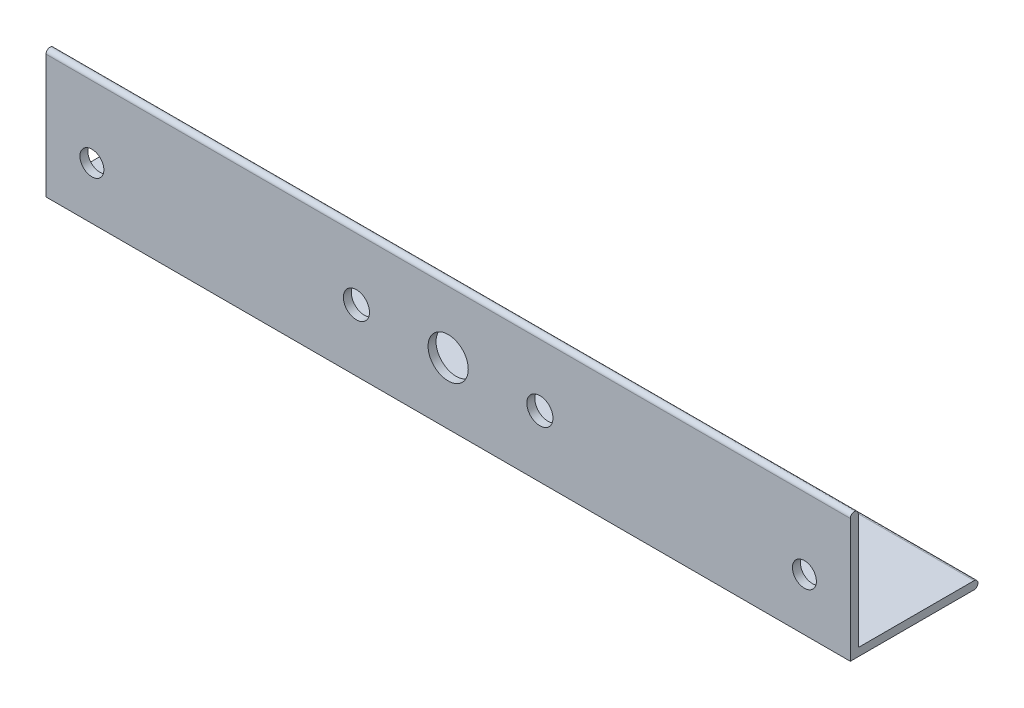
ISO-10303-21;
HEADER;
FILE_DESCRIPTION(('STEP AP214'),'2;1');
FILE_NAME('part.step','',(''),(''),'','','');
FILE_SCHEMA(('AUTOMOTIVE_DESIGN { 1 0 10303 214 1 1 1 1 }'));
ENDSEC;
DATA;
#1=APPLICATION_CONTEXT('core data for automotive mechanical design processes');
#2=APPLICATION_PROTOCOL_DEFINITION('international standard','automotive_design',2000,#1);
#3=PRODUCT_CONTEXT('',#1,'mechanical');
#4=PRODUCT('Part','Part','',(#3));
#5=PRODUCT_RELATED_PRODUCT_CATEGORY('part','',(#4));
#6=PRODUCT_DEFINITION_FORMATION('','',#4);
#7=PRODUCT_DEFINITION_CONTEXT('part definition',#1,'design');
#8=PRODUCT_DEFINITION('design','',#6,#7);
#9=PRODUCT_DEFINITION_SHAPE('','',#8);
#10=(LENGTH_UNIT() NAMED_UNIT(*) SI_UNIT(.MILLI.,.METRE.));
#11=(NAMED_UNIT(*) PLANE_ANGLE_UNIT() SI_UNIT($,.RADIAN.));
#12=(NAMED_UNIT(*) SI_UNIT($,.STERADIAN.) SOLID_ANGLE_UNIT());
#13=UNCERTAINTY_MEASURE_WITH_UNIT(LENGTH_MEASURE(1.E-05),#10,'distance_accuracy_value','');
#14=(GEOMETRIC_REPRESENTATION_CONTEXT(3) GLOBAL_UNCERTAINTY_ASSIGNED_CONTEXT((#13)) GLOBAL_UNIT_ASSIGNED_CONTEXT((#10,
#11,#12)) REPRESENTATION_CONTEXT('',''));
#15=CARTESIAN_POINT('',(0.,0.,0.));
#16=DIRECTION('',(0.,0.,1.));
#17=DIRECTION('',(1.,0.,0.));
#18=AXIS2_PLACEMENT_3D('',#15,#16,#17);
#19=CARTESIAN_POINT('',(160.,0.793749999999999,-24.60625));
#20=DIRECTION('',(-1.,0.,0.));
#21=DIRECTION('',(0.,0.,1.));
#22=AXIS2_PLACEMENT_3D('',#19,#20,#21);
#23=CYLINDRICAL_SURFACE('',#22,0.793749999999999);
#24=DIRECTION('',(-1.,0.,0.));
#25=VECTOR('',#24,1.);
#26=CARTESIAN_POINT('',(160.,1.5875,-24.60625));
#27=LINE('',#26,#25);
#28=CARTESIAN_POINT('',(160.,1.5875,-24.60625));
#29=VERTEX_POINT('',#28);
#30=CARTESIAN_POINT('',(0.,1.5875,-24.60625));
#31=VERTEX_POINT('',#30);
#32=EDGE_CURVE('E153',#29,#31,#27,.T.);
#33=ORIENTED_EDGE('',*,*,#32,.F.);
#34=CARTESIAN_POINT('',(160.,0.793749999999999,-24.60625));
#35=DIRECTION('',(-1.,0.,0.));
#36=DIRECTION('',(0.,0.,1.));
#37=AXIS2_PLACEMENT_3D('',#34,#35,#36);
#38=CIRCLE('',#37,0.793749999999999);
#39=CARTESIAN_POINT('',(160.,0.,-24.60625));
#40=VERTEX_POINT('',#39);
#41=EDGE_CURVE('E50',#40,#29,#38,.F.);
#42=ORIENTED_EDGE('',*,*,#41,.F.);
#43=DIRECTION('',(-1.,0.,0.));
#44=VECTOR('',#43,1.);
#45=CARTESIAN_POINT('',(160.,0.,-24.60625));
#46=LINE('',#45,#44);
#47=CARTESIAN_POINT('',(0.,0.,-24.60625));
#48=VERTEX_POINT('',#47);
#49=EDGE_CURVE('E156',#48,#40,#46,.F.);
#50=ORIENTED_EDGE('',*,*,#49,.F.);
#51=CARTESIAN_POINT('',(0.,0.793749999999999,-24.60625));
#52=DIRECTION('',(-1.,0.,0.));
#53=DIRECTION('',(0.,0.,1.));
#54=AXIS2_PLACEMENT_3D('',#51,#52,#53);
#55=CIRCLE('',#54,0.793749999999999);
#56=EDGE_CURVE('E11',#31,#48,#55,.T.);
#57=ORIENTED_EDGE('',*,*,#56,.F.);
#58=EDGE_LOOP('',(#33,#42,#50,#57));
#59=FACE_BOUND('',#58,.T.);
#60=ADVANCED_FACE('F41',(#59),#23,.T.);
#61=CARTESIAN_POINT('',(160.,24.60625,-0.79375));
#62=DIRECTION('',(-1.,0.,0.));
#63=DIRECTION('',(0.,0.,1.));
#64=AXIS2_PLACEMENT_3D('',#61,#62,#63);
#65=CYLINDRICAL_SURFACE('',#64,0.79375);
#66=DIRECTION('',(-1.,0.,0.));
#67=VECTOR('',#66,1.);
#68=CARTESIAN_POINT('',(160.,24.60625,0.));
#69=LINE('',#68,#67);
#70=CARTESIAN_POINT('',(160.,24.60625,0.));
#71=VERTEX_POINT('',#70);
#72=CARTESIAN_POINT('',(0.,24.60625,0.));
#73=VERTEX_POINT('',#72);
#74=EDGE_CURVE('E112',#71,#73,#69,.T.);
#75=ORIENTED_EDGE('',*,*,#74,.F.);
#76=CARTESIAN_POINT('',(160.,24.60625,-0.79375));
#77=DIRECTION('',(-1.,0.,0.));
#78=DIRECTION('',(0.,0.,1.));
#79=AXIS2_PLACEMENT_3D('',#76,#77,#78);
#80=CIRCLE('',#79,0.79375);
#81=CARTESIAN_POINT('',(160.,24.60625,-1.5875));
#82=VERTEX_POINT('',#81);
#83=EDGE_CURVE('E147',#82,#71,#80,.F.);
#84=ORIENTED_EDGE('',*,*,#83,.F.);
#85=DIRECTION('',(-1.,0.,0.));
#86=VECTOR('',#85,1.);
#87=CARTESIAN_POINT('',(160.,24.60625,-1.5875));
#88=LINE('',#87,#86);
#89=CARTESIAN_POINT('',(0.,24.60625,-1.5875));
#90=VERTEX_POINT('',#89);
#91=EDGE_CURVE('E118',#90,#82,#88,.F.);
#92=ORIENTED_EDGE('',*,*,#91,.F.);
#93=CARTESIAN_POINT('',(0.,24.60625,-0.79375));
#94=DIRECTION('',(-1.,0.,0.));
#95=DIRECTION('',(0.,0.,1.));
#96=AXIS2_PLACEMENT_3D('',#93,#94,#95);
#97=CIRCLE('',#96,0.79375);
#98=EDGE_CURVE('E150',#73,#90,#97,.T.);
#99=ORIENTED_EDGE('',*,*,#98,.F.);
#100=EDGE_LOOP('',(#75,#84,#92,#99));
#101=FACE_BOUND('',#100,.T.);
#102=ADVANCED_FACE('F224',(#101),#65,.T.);
#103=CARTESIAN_POINT('',(160.,0.,-25.4));
#104=DIRECTION('',(0.,1.,0.));
#105=DIRECTION('',(0.,0.,1.));
#106=AXIS2_PLACEMENT_3D('',#103,#104,#105);
#107=PLANE('',#106);
#108=DIRECTION('',(0.,0.,-1.));
#109=VECTOR('',#108,1.);
#110=CARTESIAN_POINT('',(0.,0.,-25.4));
#111=LINE('',#110,#109);
#112=CARTESIAN_POINT('',(0.,0.,0.));
#113=VERTEX_POINT('',#112);
#114=EDGE_CURVE('E126',#113,#48,#111,.T.);
#115=ORIENTED_EDGE('',*,*,#114,.T.);
#116=ORIENTED_EDGE('',*,*,#49,.T.);
#117=DIRECTION('',(0.,0.,-1.));
#118=VECTOR('',#117,1.);
#119=CARTESIAN_POINT('',(160.,0.,-25.4));
#120=LINE('',#119,#118);
#121=CARTESIAN_POINT('',(160.,0.,0.));
#122=VERTEX_POINT('',#121);
#123=EDGE_CURVE('E102',#122,#40,#120,.T.);
#124=ORIENTED_EDGE('',*,*,#123,.F.);
#125=DIRECTION('',(-1.,0.,0.));
#126=VECTOR('',#125,1.);
#127=CARTESIAN_POINT('',(160.,0.,0.));
#128=LINE('',#127,#126);
#129=EDGE_CURVE('E113',#122,#113,#128,.T.);
#130=ORIENTED_EDGE('',*,*,#129,.T.);
#131=EDGE_LOOP('',(#115,#116,#124,#130));
#132=FACE_BOUND('',#131,.T.);
#133=ADVANCED_FACE('F161',(#132),#107,.F.);
#134=CARTESIAN_POINT('',(160.,1.5875,-1.5875));
#135=DIRECTION('',(0.,-1.,0.));
#136=DIRECTION('',(0.,0.,-1.));
#137=AXIS2_PLACEMENT_3D('',#134,#135,#136);
#138=PLANE('',#137);
#139=DIRECTION('',(0.,0.,1.));
#140=VECTOR('',#139,1.);
#141=CARTESIAN_POINT('',(160.,1.5875,-1.5875));
#142=LINE('',#141,#140);
#143=CARTESIAN_POINT('',(160.,1.5875,-1.5875));
#144=VERTEX_POINT('',#143);
#145=EDGE_CURVE('E93',#29,#144,#142,.T.);
#146=ORIENTED_EDGE('',*,*,#145,.F.);
#147=ORIENTED_EDGE('',*,*,#32,.T.);
#148=DIRECTION('',(0.,0.,1.));
#149=VECTOR('',#148,1.);
#150=CARTESIAN_POINT('',(0.,1.5875,-1.5875));
#151=LINE('',#150,#149);
#152=CARTESIAN_POINT('',(0.,1.5875,-1.5875));
#153=VERTEX_POINT('',#152);
#154=EDGE_CURVE('E107',#31,#153,#151,.T.);
#155=ORIENTED_EDGE('',*,*,#154,.T.);
#156=DIRECTION('',(-1.,0.,0.));
#157=VECTOR('',#156,1.);
#158=CARTESIAN_POINT('',(160.,1.5875,-1.5875));
#159=LINE('',#158,#157);
#160=EDGE_CURVE('E105',#144,#153,#159,.T.);
#161=ORIENTED_EDGE('',*,*,#160,.F.);
#162=EDGE_LOOP('',(#146,#147,#155,#161));
#163=FACE_BOUND('',#162,.T.);
#164=ADVANCED_FACE('F106',(#163),#138,.F.);
#165=CARTESIAN_POINT('',(160.,25.4,-1.5875));
#166=DIRECTION('',(0.,0.,1.));
#167=DIRECTION('',(0.,-1.,0.));
#168=AXIS2_PLACEMENT_3D('',#165,#166,#167);
#169=PLANE('',#168);
#170=CARTESIAN_POINT('',(61.75,12.303125,-1.5875));
#171=DIRECTION('',(0.,0.,1.));
#172=DIRECTION('',(0.,-1.,0.));
#173=AXIS2_PLACEMENT_3D('',#170,#171,#172);
#174=CIRCLE('',#173,2.59999999999999);
#175=CARTESIAN_POINT('',(61.75,9.70312500000001,-1.5875));
#176=VERTEX_POINT('',#175);
#177=EDGE_CURVE('E178',#176,#176,#174,.T.);
#178=ORIENTED_EDGE('',*,*,#177,.T.);
#179=EDGE_LOOP('',(#178));
#180=FACE_BOUND('',#179,.T.);
#181=CARTESIAN_POINT('',(98.25,12.303125,-1.5875));
#182=DIRECTION('',(0.,0.,1.));
#183=DIRECTION('',(0.,-1.,0.));
#184=AXIS2_PLACEMENT_3D('',#181,#182,#183);
#185=CIRCLE('',#184,2.6);
#186=CARTESIAN_POINT('',(98.25,9.703125,-1.5875));
#187=VERTEX_POINT('',#186);
#188=EDGE_CURVE('E185',#187,#187,#185,.T.);
#189=ORIENTED_EDGE('',*,*,#188,.T.);
#190=EDGE_LOOP('',(#189));
#191=FACE_BOUND('',#190,.T.);
#192=CARTESIAN_POINT('',(80.,12.303125,-1.5875));
#193=DIRECTION('',(0.,0.,1.));
#194=DIRECTION('',(0.,-1.,0.));
#195=AXIS2_PLACEMENT_3D('',#192,#193,#194);
#196=CIRCLE('',#195,4.00000000000001);
#197=CARTESIAN_POINT('',(80.,8.30312499999999,-1.5875));
#198=VERTEX_POINT('',#197);
#199=EDGE_CURVE('E189',#198,#198,#196,.T.);
#200=ORIENTED_EDGE('',*,*,#199,.T.);
#201=EDGE_LOOP('',(#200));
#202=FACE_BOUND('',#201,.T.);
#203=CARTESIAN_POINT('',(9.13,10.41,-1.5875));
#204=DIRECTION('',(0.,0.,1.));
#205=DIRECTION('',(0.,1.,0.));
#206=AXIS2_PLACEMENT_3D('',#203,#204,#205);
#207=CIRCLE('',#206,2.38125000000001);
#208=CARTESIAN_POINT('',(9.13,12.79125,-1.5875));
#209=VERTEX_POINT('',#208);
#210=EDGE_CURVE('E174',#209,#209,#207,.T.);
#211=ORIENTED_EDGE('',*,*,#210,.T.);
#212=EDGE_LOOP('',(#211));
#213=FACE_BOUND('',#212,.T.);
#214=CARTESIAN_POINT('',(150.87,10.41,-1.5875));
#215=DIRECTION('',(0.,0.,-1.));
#216=DIRECTION('',(0.,1.,0.));
#217=AXIS2_PLACEMENT_3D('',#214,#215,#216);
#218=CIRCLE('',#217,2.38125000000001);
#219=CARTESIAN_POINT('',(150.87,12.79125,-1.5875));
#220=VERTEX_POINT('',#219);
#221=EDGE_CURVE('E166',#220,#220,#218,.T.);
#222=ORIENTED_EDGE('',*,*,#221,.F.);
#223=EDGE_LOOP('',(#222));
#224=FACE_BOUND('',#223,.T.);
#225=DIRECTION('',(0.,1.,0.));
#226=VECTOR('',#225,1.);
#227=CARTESIAN_POINT('',(0.,25.4,-1.5875));
#228=LINE('',#227,#226);
#229=EDGE_CURVE('E133',#153,#90,#228,.T.);
#230=ORIENTED_EDGE('',*,*,#229,.T.);
#231=ORIENTED_EDGE('',*,*,#91,.T.);
#232=DIRECTION('',(0.,1.,0.));
#233=VECTOR('',#232,1.);
#234=CARTESIAN_POINT('',(160.,25.4,-1.5875));
#235=LINE('',#234,#233);
#236=EDGE_CURVE('E98',#144,#82,#235,.T.);
#237=ORIENTED_EDGE('',*,*,#236,.F.);
#238=ORIENTED_EDGE('',*,*,#160,.T.);
#239=EDGE_LOOP('',(#230,#231,#237,#238));
#240=FACE_BOUND('',#239,.T.);
#241=ADVANCED_FACE('F116',(#180,#191,#202,#213,#224,#240),#169,.F.);
#242=CARTESIAN_POINT('',(160.,0.,0.));
#243=DIRECTION('',(0.,0.,-1.));
#244=DIRECTION('',(-1.,0.,0.));
#245=AXIS2_PLACEMENT_3D('',#242,#243,#244);
#246=PLANE('',#245);
#247=CARTESIAN_POINT('',(61.75,12.303125,0.));
#248=DIRECTION('',(0.,0.,1.));
#249=DIRECTION('',(1.,0.,0.));
#250=AXIS2_PLACEMENT_3D('',#247,#248,#249);
#251=CIRCLE('',#250,2.59999999999999);
#252=CARTESIAN_POINT('',(64.35,12.303125,0.));
#253=VERTEX_POINT('',#252);
#254=EDGE_CURVE('E198',#253,#253,#251,.T.);
#255=ORIENTED_EDGE('',*,*,#254,.F.);
#256=EDGE_LOOP('',(#255));
#257=FACE_BOUND('',#256,.T.);
#258=CARTESIAN_POINT('',(98.25,12.303125,0.));
#259=DIRECTION('',(0.,0.,1.));
#260=DIRECTION('',(1.,0.,0.));
#261=AXIS2_PLACEMENT_3D('',#258,#259,#260);
#262=CIRCLE('',#261,2.6);
#263=CARTESIAN_POINT('',(100.85,12.303125,0.));
#264=VERTEX_POINT('',#263);
#265=EDGE_CURVE('E197',#264,#264,#262,.T.);
#266=ORIENTED_EDGE('',*,*,#265,.F.);
#267=EDGE_LOOP('',(#266));
#268=FACE_BOUND('',#267,.T.);
#269=CARTESIAN_POINT('',(80.,12.303125,0.));
#270=DIRECTION('',(0.,0.,1.));
#271=DIRECTION('',(1.,0.,0.));
#272=AXIS2_PLACEMENT_3D('',#269,#270,#271);
#273=CIRCLE('',#272,4.00000000000001);
#274=CARTESIAN_POINT('',(84.,12.303125,0.));
#275=VERTEX_POINT('',#274);
#276=EDGE_CURVE('E193',#275,#275,#273,.T.);
#277=ORIENTED_EDGE('',*,*,#276,.F.);
#278=EDGE_LOOP('',(#277));
#279=FACE_BOUND('',#278,.T.);
#280=CARTESIAN_POINT('',(9.13,10.41,0.));
#281=DIRECTION('',(0.,0.,1.));
#282=DIRECTION('',(0.,1.,0.));
#283=AXIS2_PLACEMENT_3D('',#280,#281,#282);
#284=CIRCLE('',#283,2.38125000000001);
#285=CARTESIAN_POINT('',(9.13,12.79125,0.));
#286=VERTEX_POINT('',#285);
#287=EDGE_CURVE('E170',#286,#286,#284,.T.);
#288=ORIENTED_EDGE('',*,*,#287,.F.);
#289=EDGE_LOOP('',(#288));
#290=FACE_BOUND('',#289,.T.);
#291=CARTESIAN_POINT('',(150.87,10.41,0.));
#292=DIRECTION('',(0.,0.,-1.));
#293=DIRECTION('',(0.,1.,0.));
#294=AXIS2_PLACEMENT_3D('',#291,#292,#293);
#295=CIRCLE('',#294,2.38125000000001);
#296=CARTESIAN_POINT('',(150.87,12.79125,0.));
#297=VERTEX_POINT('',#296);
#298=EDGE_CURVE('E130',#297,#297,#295,.T.);
#299=ORIENTED_EDGE('',*,*,#298,.T.);
#300=EDGE_LOOP('',(#299));
#301=FACE_BOUND('',#300,.T.);
#302=DIRECTION('',(0.,-1.,0.));
#303=VECTOR('',#302,1.);
#304=CARTESIAN_POINT('',(160.,0.,0.));
#305=LINE('',#304,#303);
#306=EDGE_CURVE('E120',#71,#122,#305,.T.);
#307=ORIENTED_EDGE('',*,*,#306,.F.);
#308=ORIENTED_EDGE('',*,*,#74,.T.);
#309=DIRECTION('',(0.,-1.,0.));
#310=VECTOR('',#309,1.);
#311=CARTESIAN_POINT('',(0.,0.,0.));
#312=LINE('',#311,#310);
#313=EDGE_CURVE('E136',#73,#113,#312,.T.);
#314=ORIENTED_EDGE('',*,*,#313,.T.);
#315=ORIENTED_EDGE('',*,*,#129,.F.);
#316=EDGE_LOOP('',(#307,#308,#314,#315));
#317=FACE_BOUND('',#316,.T.);
#318=ADVANCED_FACE('F209',(#257,#268,#279,#290,#301,#317),#246,.F.);
#319=CARTESIAN_POINT('',(160.,0.,0.));
#320=DIRECTION('',(-1.,0.,0.));
#321=DIRECTION('',(0.,0.,1.));
#322=AXIS2_PLACEMENT_3D('',#319,#320,#321);
#323=PLANE('',#322);
#324=ORIENTED_EDGE('',*,*,#123,.T.);
#325=ORIENTED_EDGE('',*,*,#41,.T.);
#326=ORIENTED_EDGE('',*,*,#145,.T.);
#327=ORIENTED_EDGE('',*,*,#236,.T.);
#328=ORIENTED_EDGE('',*,*,#83,.T.);
#329=ORIENTED_EDGE('',*,*,#306,.T.);
#330=EDGE_LOOP('',(#324,#325,#326,#327,#328,#329));
#331=FACE_BOUND('',#330,.T.);
#332=ADVANCED_FACE('F96',(#331),#323,.F.);
#333=CARTESIAN_POINT('',(0.,0.,0.));
#334=DIRECTION('',(-1.,0.,0.));
#335=DIRECTION('',(0.,0.,1.));
#336=AXIS2_PLACEMENT_3D('',#333,#334,#335);
#337=PLANE('',#336);
#338=ORIENTED_EDGE('',*,*,#154,.F.);
#339=ORIENTED_EDGE('',*,*,#56,.T.);
#340=ORIENTED_EDGE('',*,*,#114,.F.);
#341=ORIENTED_EDGE('',*,*,#313,.F.);
#342=ORIENTED_EDGE('',*,*,#98,.T.);
#343=ORIENTED_EDGE('',*,*,#229,.F.);
#344=EDGE_LOOP('',(#338,#339,#340,#341,#342,#343));
#345=FACE_BOUND('',#344,.T.);
#346=ADVANCED_FACE('F222',(#345),#337,.T.);
#347=CARTESIAN_POINT('',(150.87,10.41,0.));
#348=DIRECTION('',(0.,0.,-1.));
#349=DIRECTION('',(0.,1.,0.));
#350=AXIS2_PLACEMENT_3D('',#347,#348,#349);
#351=CYLINDRICAL_SURFACE('',#350,2.38125000000001);
#352=CARTESIAN_POINT('',(150.87,12.79125,0.));
#353=CARTESIAN_POINT('',(150.87,12.79125,-0.0165364583333315));
#354=CARTESIAN_POINT('',(150.87,12.79125,-0.0330729166666649));
#355=CARTESIAN_POINT('',(150.87,12.79125,-0.0661458333333316));
#356=CARTESIAN_POINT('',(150.87,12.79125,-0.082682291666665));
#357=CARTESIAN_POINT('',(150.87,12.79125,-0.115755208333332));
#358=CARTESIAN_POINT('',(150.87,12.79125,-0.132291666666665));
#359=CARTESIAN_POINT('',(150.87,12.79125,-0.165364583333332));
#360=CARTESIAN_POINT('',(150.87,12.79125,-0.181901041666665));
#361=CARTESIAN_POINT('',(150.87,12.79125,-0.214973958333332));
#362=CARTESIAN_POINT('',(150.87,12.79125,-0.231510416666665));
#363=CARTESIAN_POINT('',(150.87,12.79125,-0.264583333333332));
#364=CARTESIAN_POINT('',(150.87,12.79125,-0.281119791666665));
#365=CARTESIAN_POINT('',(150.87,12.79125,-0.314192708333332));
#366=CARTESIAN_POINT('',(150.87,12.79125,-0.330729166666665));
#367=CARTESIAN_POINT('',(150.87,12.79125,-0.363802083333332));
#368=CARTESIAN_POINT('',(150.87,12.79125,-0.380338541666665));
#369=CARTESIAN_POINT('',(150.87,12.79125,-0.413411458333332));
#370=CARTESIAN_POINT('',(150.87,12.79125,-0.429947916666666));
#371=CARTESIAN_POINT('',(150.87,12.79125,-0.463020833333332));
#372=CARTESIAN_POINT('',(150.87,12.79125,-0.479557291666666));
#373=CARTESIAN_POINT('',(150.87,12.79125,-0.512630208333332));
#374=CARTESIAN_POINT('',(150.87,12.79125,-0.529166666666666));
#375=CARTESIAN_POINT('',(150.87,12.79125,-0.562239583333332));
#376=CARTESIAN_POINT('',(150.87,12.79125,-0.578776041666666));
#377=CARTESIAN_POINT('',(150.87,12.79125,-0.611848958333333));
#378=CARTESIAN_POINT('',(150.87,12.79125,-0.628385416666666));
#379=CARTESIAN_POINT('',(150.87,12.79125,-0.661458333333333));
#380=CARTESIAN_POINT('',(150.87,12.79125,-0.677994791666666));
#381=CARTESIAN_POINT('',(150.87,12.79125,-0.711067708333333));
#382=CARTESIAN_POINT('',(150.87,12.79125,-0.727604166666666));
#383=CARTESIAN_POINT('',(150.87,12.79125,-0.760677083333333));
#384=CARTESIAN_POINT('',(150.87,12.79125,-0.777213541666666));
#385=CARTESIAN_POINT('',(150.87,12.79125,-0.810286458333333));
#386=CARTESIAN_POINT('',(150.87,12.79125,-0.826822916666666));
#387=CARTESIAN_POINT('',(150.87,12.79125,-0.859895833333333));
#388=CARTESIAN_POINT('',(150.87,12.79125,-0.876432291666666));
#389=CARTESIAN_POINT('',(150.87,12.79125,-0.909505208333333));
#390=CARTESIAN_POINT('',(150.87,12.79125,-0.926041666666666));
#391=CARTESIAN_POINT('',(150.87,12.79125,-0.959114583333333));
#392=CARTESIAN_POINT('',(150.87,12.79125,-0.975651041666666));
#393=CARTESIAN_POINT('',(150.87,12.79125,-1.00872395833333));
#394=CARTESIAN_POINT('',(150.87,12.79125,-1.02526041666667));
#395=CARTESIAN_POINT('',(150.87,12.79125,-1.05833333333333));
#396=CARTESIAN_POINT('',(150.87,12.79125,-1.07486979166667));
#397=CARTESIAN_POINT('',(150.87,12.79125,-1.10794270833333));
#398=CARTESIAN_POINT('',(150.87,12.79125,-1.12447916666667));
#399=CARTESIAN_POINT('',(150.87,12.79125,-1.15755208333333));
#400=CARTESIAN_POINT('',(150.87,12.79125,-1.17408854166667));
#401=CARTESIAN_POINT('',(150.87,12.79125,-1.20716145833333));
#402=CARTESIAN_POINT('',(150.87,12.79125,-1.22369791666667));
#403=CARTESIAN_POINT('',(150.87,12.79125,-1.25677083333333));
#404=CARTESIAN_POINT('',(150.87,12.79125,-1.27330729166667));
#405=CARTESIAN_POINT('',(150.87,12.79125,-1.30638020833333));
#406=CARTESIAN_POINT('',(150.87,12.79125,-1.32291666666667));
#407=CARTESIAN_POINT('',(150.87,12.79125,-1.35598958333333));
#408=CARTESIAN_POINT('',(150.87,12.79125,-1.37252604166667));
#409=CARTESIAN_POINT('',(150.87,12.79125,-1.40559895833333));
#410=CARTESIAN_POINT('',(150.87,12.79125,-1.42213541666667));
#411=CARTESIAN_POINT('',(150.87,12.79125,-1.45520833333333));
#412=CARTESIAN_POINT('',(150.87,12.79125,-1.47174479166667));
#413=CARTESIAN_POINT('',(150.87,12.79125,-1.50481770833333));
#414=CARTESIAN_POINT('',(150.87,12.79125,-1.52135416666667));
#415=CARTESIAN_POINT('',(150.87,12.79125,-1.55442708333333));
#416=CARTESIAN_POINT('',(150.87,12.79125,-1.57096354166667));
#417=CARTESIAN_POINT('',(150.87,12.79125,-1.5875));
#418=B_SPLINE_CURVE_WITH_KNOTS('',3,(#352,#353,#354,#355,#356,#357,#358,#359,#360,#361,#362,
#363,#364,#365,#366,#367,#368,#369,#370,#371,#372,#373,#374,#375,#376,#377,#378,#379,#380,#381,
#382,#383,#384,#385,#386,#387,#388,#389,#390,#391,#392,#393,#394,#395,#396,#397,#398,#399,#400,
#401,#402,#403,#404,#405,#406,#407,#408,#409,#410,#411,#412,#413,#414,#415,#416,#417),
.UNSPECIFIED.,.F.,.F.,(4,2,2,2,2,2,2,2,2,2,2,2,2,2,2,2,2,2,2,2,2,2,2,2,2,2,2,2,2,2,2,2,4),(0.,
0.0496093750000001,0.0992187500000002,0.148828125,0.1984375,0.248046875,0.29765625,
0.347265625000001,0.396875000000001,0.446484375000001,0.496093750000001,0.545703125000001,
0.595312500000001,0.644921875000001,0.694531250000001,0.744140625000001,0.793750000000001,
0.843359375000001,0.892968750000001,0.942578125000002,0.992187500000002,1.041796875,1.09140625,
1.141015625,1.190625,1.240234375,1.28984375,1.339453125,1.3890625,1.438671875,1.48828125,
1.537890625,1.5875),.UNSPECIFIED.);
#419=EDGE_CURVE('BSEAM242',#297,#220,#418,.T.);
#420=ORIENTED_EDGE('',*,*,#298,.F.);
#421=ORIENTED_EDGE('',*,*,#221,.T.);
#422=ORIENTED_EDGE('',*,*,#419,.T.);
#423=ORIENTED_EDGE('',*,*,#419,.F.);
#424=EDGE_LOOP('',(#420,#422,#421,#423));
#425=FACE_BOUND('',#424,.T.);
#426=ADVANCED_FACE('F242',(#425),#351,.F.);
#427=CARTESIAN_POINT('',(9.13,10.41,0.));
#428=DIRECTION('',(0.,0.,-1.));
#429=DIRECTION('',(0.,1.,0.));
#430=AXIS2_PLACEMENT_3D('',#427,#428,#429);
#431=CYLINDRICAL_SURFACE('',#430,2.38125000000001);
#432=CARTESIAN_POINT('',(9.13,12.79125,0.));
#433=CARTESIAN_POINT('',(9.13,12.79125,-0.0165364583333298));
#434=CARTESIAN_POINT('',(9.13,12.79125,-0.0330729166666632));
#435=CARTESIAN_POINT('',(9.13,12.79125,-0.06614583333333));
#436=CARTESIAN_POINT('',(9.13,12.79125,-0.0826822916666633));
#437=CARTESIAN_POINT('',(9.13,12.79125,-0.11575520833333));
#438=CARTESIAN_POINT('',(9.13,12.79125,-0.132291666666663));
#439=CARTESIAN_POINT('',(9.13,12.79125,-0.16536458333333));
#440=CARTESIAN_POINT('',(9.13,12.79125,-0.181901041666664));
#441=CARTESIAN_POINT('',(9.13,12.79125,-0.21497395833333));
#442=CARTESIAN_POINT('',(9.13,12.79125,-0.231510416666664));
#443=CARTESIAN_POINT('',(9.13,12.79125,-0.264583333333331));
#444=CARTESIAN_POINT('',(9.13,12.79125,-0.281119791666664));
#445=CARTESIAN_POINT('',(9.13,12.79125,-0.314192708333331));
#446=CARTESIAN_POINT('',(9.13,12.79125,-0.330729166666664));
#447=CARTESIAN_POINT('',(9.13,12.79125,-0.363802083333331));
#448=CARTESIAN_POINT('',(9.13,12.79125,-0.380338541666664));
#449=CARTESIAN_POINT('',(9.13,12.79125,-0.413411458333331));
#450=CARTESIAN_POINT('',(9.13,12.79125,-0.429947916666664));
#451=CARTESIAN_POINT('',(9.13,12.79125,-0.463020833333331));
#452=CARTESIAN_POINT('',(9.13,12.79125,-0.479557291666664));
#453=CARTESIAN_POINT('',(9.13,12.79125,-0.512630208333331));
#454=CARTESIAN_POINT('',(9.13,12.79125,-0.529166666666665));
#455=CARTESIAN_POINT('',(9.13,12.79125,-0.562239583333331));
#456=CARTESIAN_POINT('',(9.13,12.79125,-0.578776041666665));
#457=CARTESIAN_POINT('',(9.13,12.79125,-0.611848958333331));
#458=CARTESIAN_POINT('',(9.13,12.79125,-0.628385416666665));
#459=CARTESIAN_POINT('',(9.13,12.79125,-0.661458333333332));
#460=CARTESIAN_POINT('',(9.13,12.79125,-0.677994791666665));
#461=CARTESIAN_POINT('',(9.13,12.79125,-0.711067708333332));
#462=CARTESIAN_POINT('',(9.13,12.79125,-0.727604166666665));
#463=CARTESIAN_POINT('',(9.13,12.79125,-0.760677083333332));
#464=CARTESIAN_POINT('',(9.13,12.79125,-0.777213541666665));
#465=CARTESIAN_POINT('',(9.13,12.79125,-0.810286458333332));
#466=CARTESIAN_POINT('',(9.13,12.79125,-0.826822916666666));
#467=CARTESIAN_POINT('',(9.13,12.79125,-0.859895833333332));
#468=CARTESIAN_POINT('',(9.13,12.79125,-0.876432291666666));
#469=CARTESIAN_POINT('',(9.13,12.79125,-0.909505208333332));
#470=CARTESIAN_POINT('',(9.13,12.79125,-0.926041666666666));
#471=CARTESIAN_POINT('',(9.13,12.79125,-0.959114583333333));
#472=CARTESIAN_POINT('',(9.13,12.79125,-0.975651041666666));
#473=CARTESIAN_POINT('',(9.13,12.79125,-1.00872395833333));
#474=CARTESIAN_POINT('',(9.13,12.79125,-1.02526041666667));
#475=CARTESIAN_POINT('',(9.13,12.79125,-1.05833333333333));
#476=CARTESIAN_POINT('',(9.13,12.79125,-1.07486979166667));
#477=CARTESIAN_POINT('',(9.13,12.79125,-1.10794270833333));
#478=CARTESIAN_POINT('',(9.13,12.79125,-1.12447916666667));
#479=CARTESIAN_POINT('',(9.13,12.79125,-1.15755208333333));
#480=CARTESIAN_POINT('',(9.13,12.79125,-1.17408854166667));
#481=CARTESIAN_POINT('',(9.13,12.79125,-1.20716145833333));
#482=CARTESIAN_POINT('',(9.13,12.79125,-1.22369791666667));
#483=CARTESIAN_POINT('',(9.13,12.79125,-1.25677083333333));
#484=CARTESIAN_POINT('',(9.13,12.79125,-1.27330729166667));
#485=CARTESIAN_POINT('',(9.13,12.79125,-1.30638020833333));
#486=CARTESIAN_POINT('',(9.13,12.79125,-1.32291666666667));
#487=CARTESIAN_POINT('',(9.13,12.79125,-1.35598958333333));
#488=CARTESIAN_POINT('',(9.13,12.79125,-1.37252604166667));
#489=CARTESIAN_POINT('',(9.13,12.79125,-1.40559895833333));
#490=CARTESIAN_POINT('',(9.13,12.79125,-1.42213541666667));
#491=CARTESIAN_POINT('',(9.13,12.79125,-1.45520833333333));
#492=CARTESIAN_POINT('',(9.13,12.79125,-1.47174479166667));
#493=CARTESIAN_POINT('',(9.13,12.79125,-1.50481770833333));
#494=CARTESIAN_POINT('',(9.13,12.79125,-1.52135416666667));
#495=CARTESIAN_POINT('',(9.13,12.79125,-1.55442708333333));
#496=CARTESIAN_POINT('',(9.13,12.79125,-1.57096354166667));
#497=CARTESIAN_POINT('',(9.13,12.79125,-1.5875));
#498=B_SPLINE_CURVE_WITH_KNOTS('',3,(#432,#433,#434,#435,#436,#437,#438,#439,#440,#441,#442,
#443,#444,#445,#446,#447,#448,#449,#450,#451,#452,#453,#454,#455,#456,#457,#458,#459,#460,#461,
#462,#463,#464,#465,#466,#467,#468,#469,#470,#471,#472,#473,#474,#475,#476,#477,#478,#479,#480,
#481,#482,#483,#484,#485,#486,#487,#488,#489,#490,#491,#492,#493,#494,#495,#496,#497),
.UNSPECIFIED.,.F.,.F.,(4,2,2,2,2,2,2,2,2,2,2,2,2,2,2,2,2,2,2,2,2,2,2,2,2,2,2,2,2,2,2,2,4),(0.,
0.0496093750000001,0.0992187500000003,0.148828125,0.198437500000001,0.248046875000001,
0.297656250000001,0.347265625000001,0.396875000000001,0.446484375000001,0.496093750000001,
0.545703125000001,0.595312500000002,0.644921875000002,0.694531250000002,0.744140625000002,
0.793750000000002,0.843359375000002,0.892968750000003,0.942578125000003,0.992187500000003,
1.041796875,1.09140625,1.141015625,1.190625,1.240234375,1.28984375,1.339453125,1.3890625,
1.438671875,1.48828125,1.537890625,1.5875),.UNSPECIFIED.);
#499=EDGE_CURVE('BSEAM247',#286,#209,#498,.T.);
#500=ORIENTED_EDGE('',*,*,#287,.T.);
#501=ORIENTED_EDGE('',*,*,#210,.F.);
#502=ORIENTED_EDGE('',*,*,#499,.T.);
#503=ORIENTED_EDGE('',*,*,#499,.F.);
#504=EDGE_LOOP('',(#500,#502,#501,#503));
#505=FACE_BOUND('',#504,.T.);
#506=ADVANCED_FACE('F247',(#505),#431,.F.);
#507=CARTESIAN_POINT('',(80.,12.303125,-10.));
#508=DIRECTION('',(0.,0.,1.));
#509=DIRECTION('',(1.,0.,0.));
#510=AXIS2_PLACEMENT_3D('',#507,#508,#509);
#511=CYLINDRICAL_SURFACE('',#510,4.00000000000001);
#512=ORIENTED_EDGE('',*,*,#276,.T.);
#513=EDGE_LOOP('',(#512));
#514=FACE_BOUND('',#513,.T.);
#515=ORIENTED_EDGE('',*,*,#199,.F.);
#516=EDGE_LOOP('',(#515));
#517=FACE_BOUND('',#516,.T.);
#518=ADVANCED_FACE('F251',(#514,#517),#511,.F.);
#519=CARTESIAN_POINT('',(98.25,12.303125,-10.));
#520=DIRECTION('',(0.,0.,1.));
#521=DIRECTION('',(1.,0.,0.));
#522=AXIS2_PLACEMENT_3D('',#519,#520,#521);
#523=CYLINDRICAL_SURFACE('',#522,2.6);
#524=ORIENTED_EDGE('',*,*,#265,.T.);
#525=EDGE_LOOP('',(#524));
#526=FACE_BOUND('',#525,.T.);
#527=ORIENTED_EDGE('',*,*,#188,.F.);
#528=EDGE_LOOP('',(#527));
#529=FACE_BOUND('',#528,.T.);
#530=ADVANCED_FACE('F206',(#526,#529),#523,.F.);
#531=CARTESIAN_POINT('',(61.75,12.303125,-10.));
#532=DIRECTION('',(0.,0.,1.));
#533=DIRECTION('',(1.,0.,0.));
#534=AXIS2_PLACEMENT_3D('',#531,#532,#533);
#535=CYLINDRICAL_SURFACE('',#534,2.59999999999999);
#536=ORIENTED_EDGE('',*,*,#254,.T.);
#537=EDGE_LOOP('',(#536));
#538=FACE_BOUND('',#537,.T.);
#539=ORIENTED_EDGE('',*,*,#177,.F.);
#540=EDGE_LOOP('',(#539));
#541=FACE_BOUND('',#540,.T.);
#542=ADVANCED_FACE('F256',(#538,#541),#535,.F.);
#543=CLOSED_SHELL('',(#60,#102,#133,#164,#241,#318,#332,#346,#426,#506,#518,#530,#542));
#544=MANIFOLD_SOLID_BREP('B2',#543);
#545=ADVANCED_BREP_SHAPE_REPRESENTATION('',(#18,#544),#14);
#546=SHAPE_DEFINITION_REPRESENTATION(#9,#545);
ENDSEC;
END-ISO-10303-21;
